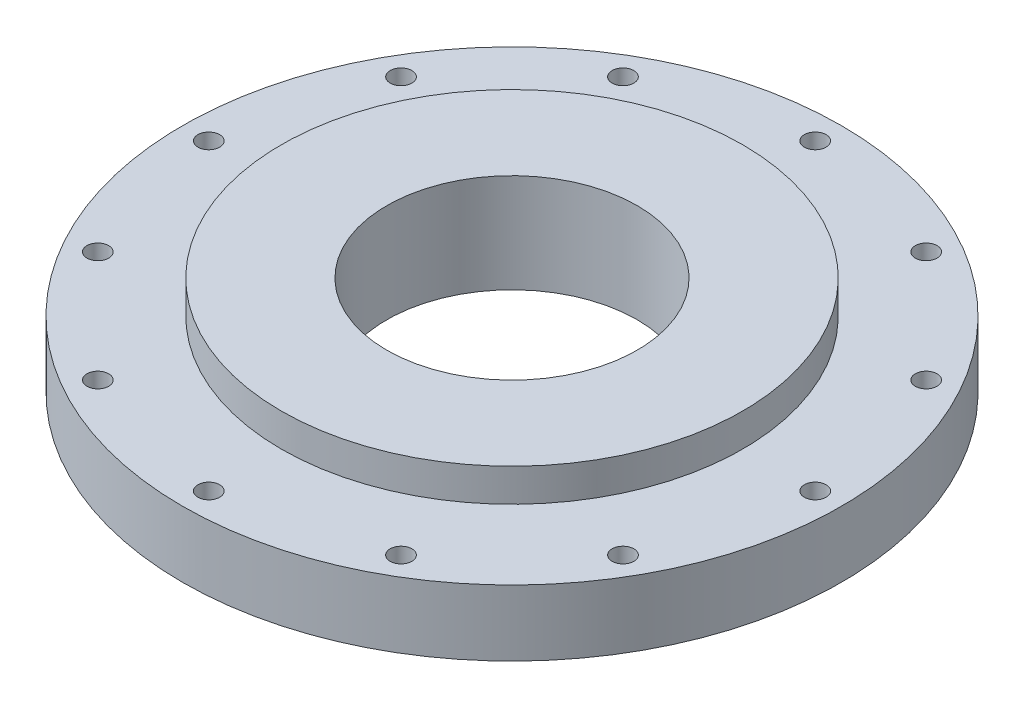
ISO-10303-21;
HEADER;
FILE_DESCRIPTION(('STEP AP214'),'2;1');
FILE_NAME('part.step','',(''),(''),'','','');
FILE_SCHEMA(('AUTOMOTIVE_DESIGN { 1 0 10303 214 1 1 1 1 }'));
ENDSEC;
DATA;
#1=APPLICATION_CONTEXT('core data for automotive mechanical design processes');
#2=APPLICATION_PROTOCOL_DEFINITION('international standard','automotive_design',2000,#1);
#3=PRODUCT_CONTEXT('',#1,'mechanical');
#4=PRODUCT('Part','Part','',(#3));
#5=PRODUCT_RELATED_PRODUCT_CATEGORY('part','',(#4));
#6=PRODUCT_DEFINITION_FORMATION('','',#4);
#7=PRODUCT_DEFINITION_CONTEXT('part definition',#1,'design');
#8=PRODUCT_DEFINITION('design','',#6,#7);
#9=PRODUCT_DEFINITION_SHAPE('','',#8);
#10=(LENGTH_UNIT() NAMED_UNIT(*) SI_UNIT(.MILLI.,.METRE.));
#11=(NAMED_UNIT(*) PLANE_ANGLE_UNIT() SI_UNIT($,.RADIAN.));
#12=(NAMED_UNIT(*) SI_UNIT($,.STERADIAN.) SOLID_ANGLE_UNIT());
#13=UNCERTAINTY_MEASURE_WITH_UNIT(LENGTH_MEASURE(1.E-05),#10,'distance_accuracy_value','');
#14=(GEOMETRIC_REPRESENTATION_CONTEXT(3) GLOBAL_UNCERTAINTY_ASSIGNED_CONTEXT((#13)) GLOBAL_UNIT_ASSIGNED_CONTEXT((#10,
#11,#12)) REPRESENTATION_CONTEXT('',''));
#15=CARTESIAN_POINT('',(0.,0.,0.));
#16=DIRECTION('',(0.,0.,1.));
#17=DIRECTION('',(1.,0.,0.));
#18=AXIS2_PLACEMENT_3D('',#15,#16,#17);
#19=CARTESIAN_POINT('',(0.,12.7,0.));
#20=DIRECTION('',(0.,-1.,0.));
#21=DIRECTION('',(0.,0.,-1.));
#22=AXIS2_PLACEMENT_3D('',#19,#20,#21);
#23=CYLINDRICAL_SURFACE('',#22,63.5);
#24=CARTESIAN_POINT('',(0.,12.7,0.));
#25=DIRECTION('',(0.,1.,0.));
#26=DIRECTION('',(0.,0.,1.));
#27=AXIS2_PLACEMENT_3D('',#24,#25,#26);
#28=CIRCLE('',#27,63.5);
#29=CARTESIAN_POINT('',(0.,12.7,63.5));
#30=VERTEX_POINT('',#29);
#31=EDGE_CURVE('E45',#30,#30,#28,.T.);
#32=ORIENTED_EDGE('',*,*,#31,.F.);
#33=EDGE_LOOP('',(#32));
#34=FACE_BOUND('',#33,.T.);
#35=CARTESIAN_POINT('',(0.,0.,0.));
#36=DIRECTION('',(0.,1.,0.));
#37=DIRECTION('',(0.,0.,1.));
#38=AXIS2_PLACEMENT_3D('',#35,#36,#37);
#39=CIRCLE('',#38,63.5);
#40=CARTESIAN_POINT('',(0.,0.,63.5));
#41=VERTEX_POINT('',#40);
#42=EDGE_CURVE('E51',#41,#41,#39,.T.);
#43=ORIENTED_EDGE('',*,*,#42,.T.);
#44=EDGE_LOOP('',(#43));
#45=FACE_BOUND('',#44,.T.);
#46=ADVANCED_FACE('F37',(#34,#45),#23,.T.);
#47=CARTESIAN_POINT('',(0.,12.7,0.));
#48=DIRECTION('',(0.,1.,0.));
#49=DIRECTION('',(0.,0.,1.));
#50=AXIS2_PLACEMENT_3D('',#47,#48,#49);
#51=PLANE('',#50);
#52=CARTESIAN_POINT('',(0.,12.7,-58.42));
#53=DIRECTION('',(0.,1.,0.));
#54=DIRECTION('',(0.,0.,1.));
#55=AXIS2_PLACEMENT_3D('',#52,#53,#54);
#56=CIRCLE('',#55,2.0955);
#57=CARTESIAN_POINT('',(0.,12.7,-56.3245));
#58=VERTEX_POINT('',#57);
#59=EDGE_CURVE('E71',#58,#58,#56,.T.);
#60=ORIENTED_EDGE('',*,*,#59,.F.);
#61=EDGE_LOOP('',(#60));
#62=FACE_BOUND('',#61,.T.);
#63=CARTESIAN_POINT('',(29.2099999999994,12.7,-50.5932040890873));
#64=DIRECTION('',(0.,1.,0.));
#65=DIRECTION('',(0.,0.,1.));
#66=AXIS2_PLACEMENT_3D('',#63,#64,#65);
#67=CIRCLE('',#66,2.0955);
#68=CARTESIAN_POINT('',(29.2099999999994,12.7,-48.4977040890873));
#69=VERTEX_POINT('',#68);
#70=EDGE_CURVE('E76',#69,#69,#67,.T.);
#71=ORIENTED_EDGE('',*,*,#70,.F.);
#72=EDGE_LOOP('',(#71));
#73=FACE_BOUND('',#72,.T.);
#74=CARTESIAN_POINT('',(50.5932040890866,12.7,-29.2100000000006));
#75=DIRECTION('',(0.,1.,0.));
#76=DIRECTION('',(0.,0.,1.));
#77=AXIS2_PLACEMENT_3D('',#74,#75,#76);
#78=CIRCLE('',#77,2.0955);
#79=CARTESIAN_POINT('',(50.5932040890866,12.7,-27.1145000000006));
#80=VERTEX_POINT('',#79);
#81=EDGE_CURVE('E82',#80,#80,#78,.T.);
#82=ORIENTED_EDGE('',*,*,#81,.F.);
#83=EDGE_LOOP('',(#82));
#84=FACE_BOUND('',#83,.T.);
#85=CARTESIAN_POINT('',(58.42,12.7,-6.11917019445648E-13));
#86=DIRECTION('',(0.,1.,0.));
#87=DIRECTION('',(0.,0.,1.));
#88=AXIS2_PLACEMENT_3D('',#85,#86,#87);
#89=CIRCLE('',#88,2.0955);
#90=CARTESIAN_POINT('',(58.42,12.7,2.09549999999939));
#91=VERTEX_POINT('',#90);
#92=EDGE_CURVE('E86',#91,#91,#89,.T.);
#93=ORIENTED_EDGE('',*,*,#92,.F.);
#94=EDGE_LOOP('',(#93));
#95=FACE_BOUND('',#94,.T.);
#96=CARTESIAN_POINT('',(-29.2100000000001,12.7,-50.5932040890869));
#97=DIRECTION('',(0.,1.,0.));
#98=DIRECTION('',(0.,0.,1.));
#99=AXIS2_PLACEMENT_3D('',#96,#97,#98);
#100=CIRCLE('',#99,2.0955);
#101=CARTESIAN_POINT('',(-29.2100000000001,12.7,-48.4977040890869));
#102=VERTEX_POINT('',#101);
#103=EDGE_CURVE('E90',#102,#102,#100,.T.);
#104=ORIENTED_EDGE('',*,*,#103,.F.);
#105=EDGE_LOOP('',(#104));
#106=FACE_BOUND('',#105,.T.);
#107=CARTESIAN_POINT('',(-50.593204089087,12.7,-29.2099999999999));
#108=DIRECTION('',(0.,1.,0.));
#109=DIRECTION('',(0.,0.,1.));
#110=AXIS2_PLACEMENT_3D('',#107,#108,#109);
#111=CIRCLE('',#110,2.0955);
#112=CARTESIAN_POINT('',(-50.593204089087,12.7,-27.1144999999999));
#113=VERTEX_POINT('',#112);
#114=EDGE_CURVE('E94',#113,#113,#111,.T.);
#115=ORIENTED_EDGE('',*,*,#114,.F.);
#116=EDGE_LOOP('',(#115));
#117=FACE_BOUND('',#116,.T.);
#118=CARTESIAN_POINT('',(-58.42,12.7,2.03972339815216E-13));
#119=DIRECTION('',(0.,1.,0.));
#120=DIRECTION('',(0.,0.,1.));
#121=AXIS2_PLACEMENT_3D('',#118,#119,#120);
#122=CIRCLE('',#121,2.0955);
#123=CARTESIAN_POINT('',(-58.42,12.7,2.09550000000021));
#124=VERTEX_POINT('',#123);
#125=EDGE_CURVE('E98',#124,#124,#122,.T.);
#126=ORIENTED_EDGE('',*,*,#125,.F.);
#127=EDGE_LOOP('',(#126));
#128=FACE_BOUND('',#127,.T.);
#129=CARTESIAN_POINT('',(-50.5932040890868,12.7,29.2100000000002));
#130=DIRECTION('',(0.,1.,0.));
#131=DIRECTION('',(0.,0.,1.));
#132=AXIS2_PLACEMENT_3D('',#129,#130,#131);
#133=CIRCLE('',#132,2.0955);
#134=CARTESIAN_POINT('',(-50.5932040890868,12.7,31.3055000000002));
#135=VERTEX_POINT('',#134);
#136=EDGE_CURVE('E102',#135,#135,#133,.T.);
#137=ORIENTED_EDGE('',*,*,#136,.F.);
#138=EDGE_LOOP('',(#137));
#139=FACE_BOUND('',#138,.T.);
#140=CARTESIAN_POINT('',(-29.2099999999997,12.7,50.5932040890871));
#141=DIRECTION('',(0.,1.,0.));
#142=DIRECTION('',(0.,0.,1.));
#143=AXIS2_PLACEMENT_3D('',#140,#141,#142);
#144=CIRCLE('',#143,2.0955);
#145=CARTESIAN_POINT('',(-29.2099999999997,12.7,52.6887040890871));
#146=VERTEX_POINT('',#145);
#147=EDGE_CURVE('E106',#146,#146,#144,.T.);
#148=ORIENTED_EDGE('',*,*,#147,.F.);
#149=EDGE_LOOP('',(#148));
#150=FACE_BOUND('',#149,.T.);
#151=CARTESIAN_POINT('',(4.07944679630432E-13,12.7,58.42));
#152=DIRECTION('',(0.,1.,0.));
#153=DIRECTION('',(0.,0.,1.));
#154=AXIS2_PLACEMENT_3D('',#151,#152,#153);
#155=CIRCLE('',#154,2.0955);
#156=CARTESIAN_POINT('',(4.07944679630432E-13,12.7,60.5155));
#157=VERTEX_POINT('',#156);
#158=EDGE_CURVE('E110',#157,#157,#155,.T.);
#159=ORIENTED_EDGE('',*,*,#158,.F.);
#160=EDGE_LOOP('',(#159));
#161=FACE_BOUND('',#160,.T.);
#162=CARTESIAN_POINT('',(29.2100000000004,12.7,50.5932040890867));
#163=DIRECTION('',(0.,1.,0.));
#164=DIRECTION('',(0.,0.,1.));
#165=AXIS2_PLACEMENT_3D('',#162,#163,#164);
#166=CIRCLE('',#165,2.0955);
#167=CARTESIAN_POINT('',(29.2100000000004,12.7,52.6887040890867));
#168=VERTEX_POINT('',#167);
#169=EDGE_CURVE('E114',#168,#168,#166,.T.);
#170=ORIENTED_EDGE('',*,*,#169,.F.);
#171=EDGE_LOOP('',(#170));
#172=FACE_BOUND('',#171,.T.);
#173=CARTESIAN_POINT('',(50.5932040890872,12.7,29.2099999999995));
#174=DIRECTION('',(0.,1.,0.));
#175=DIRECTION('',(0.,0.,1.));
#176=AXIS2_PLACEMENT_3D('',#173,#174,#175);
#177=CIRCLE('',#176,2.09550000000001);
#178=CARTESIAN_POINT('',(50.5932040890872,12.7,31.3054999999995));
#179=VERTEX_POINT('',#178);
#180=EDGE_CURVE('E118',#179,#179,#177,.T.);
#181=ORIENTED_EDGE('',*,*,#180,.F.);
#182=EDGE_LOOP('',(#181));
#183=FACE_BOUND('',#182,.T.);
#184=CARTESIAN_POINT('',(0.,12.7,0.));
#185=DIRECTION('',(0.,1.,0.));
#186=DIRECTION('',(0.,0.,1.));
#187=AXIS2_PLACEMENT_3D('',#184,#185,#186);
#188=CIRCLE('',#187,44.45);
#189=CARTESIAN_POINT('',(0.,12.7,44.45));
#190=VERTEX_POINT('',#189);
#191=EDGE_CURVE('E10',#190,#190,#188,.T.);
#192=ORIENTED_EDGE('',*,*,#191,.F.);
#193=EDGE_LOOP('',(#192));
#194=FACE_BOUND('',#193,.T.);
#195=ORIENTED_EDGE('',*,*,#31,.T.);
#196=EDGE_LOOP('',(#195));
#197=FACE_BOUND('',#196,.T.);
#198=ADVANCED_FACE('F177',(#62,#73,#84,#95,#106,#117,#128,#139,#150,#161,#172,#183,#194,#197),
#51,.T.);
#199=CARTESIAN_POINT('',(0.,0.,0.));
#200=DIRECTION('',(0.,1.,0.));
#201=DIRECTION('',(0.,0.,1.));
#202=AXIS2_PLACEMENT_3D('',#199,#200,#201);
#203=PLANE('',#202);
#204=CARTESIAN_POINT('',(0.,0.,-58.42));
#205=DIRECTION('',(0.,-1.,0.));
#206=DIRECTION('',(0.,0.,-1.));
#207=AXIS2_PLACEMENT_3D('',#204,#205,#206);
#208=CIRCLE('',#207,2.0955);
#209=CARTESIAN_POINT('',(0.,0.,-60.5155));
#210=VERTEX_POINT('',#209);
#211=EDGE_CURVE('E122',#210,#210,#208,.T.);
#212=ORIENTED_EDGE('',*,*,#211,.F.);
#213=EDGE_LOOP('',(#212));
#214=FACE_BOUND('',#213,.T.);
#215=CARTESIAN_POINT('',(29.2099999999994,0.,-50.5932040890873));
#216=DIRECTION('',(0.,-1.,0.));
#217=DIRECTION('',(0.,0.,-1.));
#218=AXIS2_PLACEMENT_3D('',#215,#216,#217);
#219=CIRCLE('',#218,2.0955);
#220=CARTESIAN_POINT('',(29.2099999999994,0.,-52.6887040890873));
#221=VERTEX_POINT('',#220);
#222=EDGE_CURVE('E156',#221,#221,#219,.T.);
#223=ORIENTED_EDGE('',*,*,#222,.F.);
#224=EDGE_LOOP('',(#223));
#225=FACE_BOUND('',#224,.T.);
#226=CARTESIAN_POINT('',(50.5932040890866,0.,-29.2100000000006));
#227=DIRECTION('',(0.,-1.,0.));
#228=DIRECTION('',(0.,0.,-1.));
#229=AXIS2_PLACEMENT_3D('',#226,#227,#228);
#230=CIRCLE('',#229,2.0955);
#231=CARTESIAN_POINT('',(50.5932040890866,0.,-31.3055000000006));
#232=VERTEX_POINT('',#231);
#233=EDGE_CURVE('E160',#232,#232,#230,.T.);
#234=ORIENTED_EDGE('',*,*,#233,.F.);
#235=EDGE_LOOP('',(#234));
#236=FACE_BOUND('',#235,.T.);
#237=CARTESIAN_POINT('',(58.42,0.,-6.11917019445648E-13));
#238=DIRECTION('',(0.,-1.,0.));
#239=DIRECTION('',(0.,0.,-1.));
#240=AXIS2_PLACEMENT_3D('',#237,#238,#239);
#241=CIRCLE('',#240,2.0955);
#242=CARTESIAN_POINT('',(58.42,0.,-2.09550000000061));
#243=VERTEX_POINT('',#242);
#244=EDGE_CURVE('E145',#243,#243,#241,.T.);
#245=ORIENTED_EDGE('',*,*,#244,.F.);
#246=EDGE_LOOP('',(#245));
#247=FACE_BOUND('',#246,.T.);
#248=CARTESIAN_POINT('',(-29.2100000000001,0.,-50.5932040890869));
#249=DIRECTION('',(0.,-1.,0.));
#250=DIRECTION('',(0.,0.,-1.));
#251=AXIS2_PLACEMENT_3D('',#248,#249,#250);
#252=CIRCLE('',#251,2.0955);
#253=CARTESIAN_POINT('',(-29.2100000000001,0.,-52.6887040890869));
#254=VERTEX_POINT('',#253);
#255=EDGE_CURVE('E136',#254,#254,#252,.T.);
#256=ORIENTED_EDGE('',*,*,#255,.F.);
#257=EDGE_LOOP('',(#256));
#258=FACE_BOUND('',#257,.T.);
#259=CARTESIAN_POINT('',(-50.593204089087,0.,-29.2099999999999));
#260=DIRECTION('',(0.,-1.,0.));
#261=DIRECTION('',(0.,0.,-1.));
#262=AXIS2_PLACEMENT_3D('',#259,#260,#261);
#263=CIRCLE('',#262,2.0955);
#264=CARTESIAN_POINT('',(-50.593204089087,0.,-31.3054999999999));
#265=VERTEX_POINT('',#264);
#266=EDGE_CURVE('E132',#265,#265,#263,.T.);
#267=ORIENTED_EDGE('',*,*,#266,.F.);
#268=EDGE_LOOP('',(#267));
#269=FACE_BOUND('',#268,.T.);
#270=CARTESIAN_POINT('',(-58.42,0.,2.03972339815216E-13));
#271=DIRECTION('',(0.,-1.,0.));
#272=DIRECTION('',(0.,0.,-1.));
#273=AXIS2_PLACEMENT_3D('',#270,#271,#272);
#274=CIRCLE('',#273,2.0955);
#275=CARTESIAN_POINT('',(-58.42,0.,-2.0954999999998));
#276=VERTEX_POINT('',#275);
#277=EDGE_CURVE('E127',#276,#276,#274,.T.);
#278=ORIENTED_EDGE('',*,*,#277,.F.);
#279=EDGE_LOOP('',(#278));
#280=FACE_BOUND('',#279,.T.);
#281=CARTESIAN_POINT('',(-50.5932040890868,0.,29.2100000000002));
#282=DIRECTION('',(0.,-1.,0.));
#283=DIRECTION('',(0.,0.,-1.));
#284=AXIS2_PLACEMENT_3D('',#281,#282,#283);
#285=CIRCLE('',#284,2.0955);
#286=CARTESIAN_POINT('',(-50.5932040890868,0.,27.1145000000002));
#287=VERTEX_POINT('',#286);
#288=EDGE_CURVE('E123',#287,#287,#285,.T.);
#289=ORIENTED_EDGE('',*,*,#288,.F.);
#290=EDGE_LOOP('',(#289));
#291=FACE_BOUND('',#290,.T.);
#292=CARTESIAN_POINT('',(-29.2099999999997,0.,50.5932040890871));
#293=DIRECTION('',(0.,-1.,0.));
#294=DIRECTION('',(0.,0.,-1.));
#295=AXIS2_PLACEMENT_3D('',#292,#293,#294);
#296=CIRCLE('',#295,2.0955);
#297=CARTESIAN_POINT('',(-29.2099999999997,0.,48.4977040890871));
#298=VERTEX_POINT('',#297);
#299=EDGE_CURVE('E128',#298,#298,#296,.T.);
#300=ORIENTED_EDGE('',*,*,#299,.F.);
#301=EDGE_LOOP('',(#300));
#302=FACE_BOUND('',#301,.T.);
#303=CARTESIAN_POINT('',(4.07944679630432E-13,0.,58.42));
#304=DIRECTION('',(0.,-1.,0.));
#305=DIRECTION('',(0.,0.,-1.));
#306=AXIS2_PLACEMENT_3D('',#303,#304,#305);
#307=CIRCLE('',#306,2.0955);
#308=CARTESIAN_POINT('',(4.07944679630432E-13,0.,56.3245));
#309=VERTEX_POINT('',#308);
#310=EDGE_CURVE('E149',#309,#309,#307,.T.);
#311=ORIENTED_EDGE('',*,*,#310,.F.);
#312=EDGE_LOOP('',(#311));
#313=FACE_BOUND('',#312,.T.);
#314=CARTESIAN_POINT('',(29.2100000000004,0.,50.5932040890867));
#315=DIRECTION('',(0.,-1.,0.));
#316=DIRECTION('',(0.,0.,-1.));
#317=AXIS2_PLACEMENT_3D('',#314,#315,#316);
#318=CIRCLE('',#317,2.0955);
#319=CARTESIAN_POINT('',(29.2100000000004,0.,48.4977040890867));
#320=VERTEX_POINT('',#319);
#321=EDGE_CURVE('E144',#320,#320,#318,.T.);
#322=ORIENTED_EDGE('',*,*,#321,.F.);
#323=EDGE_LOOP('',(#322));
#324=FACE_BOUND('',#323,.T.);
#325=CARTESIAN_POINT('',(50.5932040890872,0.,29.2099999999995));
#326=DIRECTION('',(0.,-1.,0.));
#327=DIRECTION('',(0.,0.,-1.));
#328=AXIS2_PLACEMENT_3D('',#325,#326,#327);
#329=CIRCLE('',#328,2.09550000000001);
#330=CARTESIAN_POINT('',(50.5932040890872,0.,27.1144999999995));
#331=VERTEX_POINT('',#330);
#332=EDGE_CURVE('E140',#331,#331,#329,.T.);
#333=ORIENTED_EDGE('',*,*,#332,.F.);
#334=EDGE_LOOP('',(#333));
#335=FACE_BOUND('',#334,.T.);
#336=CARTESIAN_POINT('',(0.,0.,0.));
#337=DIRECTION('',(0.,1.,0.));
#338=DIRECTION('',(0.,0.,1.));
#339=AXIS2_PLACEMENT_3D('',#336,#337,#338);
#340=CIRCLE('',#339,24.13);
#341=CARTESIAN_POINT('',(0.,0.,24.13));
#342=VERTEX_POINT('',#341);
#343=EDGE_CURVE('E66',#342,#342,#340,.T.);
#344=ORIENTED_EDGE('',*,*,#343,.T.);
#345=EDGE_LOOP('',(#344));
#346=FACE_BOUND('',#345,.T.);
#347=ORIENTED_EDGE('',*,*,#42,.F.);
#348=EDGE_LOOP('',(#347));
#349=FACE_BOUND('',#348,.T.);
#350=ADVANCED_FACE('F173',(#214,#225,#236,#247,#258,#269,#280,#291,#302,#313,#324,#335,#346,
#349),#203,.F.);
#351=CARTESIAN_POINT('',(0.,19.05,0.));
#352=DIRECTION('',(0.,-1.,0.));
#353=DIRECTION('',(0.,0.,-1.));
#354=AXIS2_PLACEMENT_3D('',#351,#352,#353);
#355=CYLINDRICAL_SURFACE('',#354,44.45);
#356=CARTESIAN_POINT('',(0.,19.05,0.));
#357=DIRECTION('',(0.,1.,0.));
#358=DIRECTION('',(0.,0.,1.));
#359=AXIS2_PLACEMENT_3D('',#356,#357,#358);
#360=CIRCLE('',#359,44.45);
#361=CARTESIAN_POINT('',(0.,19.05,44.45));
#362=VERTEX_POINT('',#361);
#363=EDGE_CURVE('E54',#362,#362,#360,.T.);
#364=ORIENTED_EDGE('',*,*,#363,.F.);
#365=EDGE_LOOP('',(#364));
#366=FACE_BOUND('',#365,.T.);
#367=ORIENTED_EDGE('',*,*,#191,.T.);
#368=EDGE_LOOP('',(#367));
#369=FACE_BOUND('',#368,.T.);
#370=ADVANCED_FACE('F176',(#366,#369),#355,.T.);
#371=CARTESIAN_POINT('',(0.,19.05,0.));
#372=DIRECTION('',(0.,1.,0.));
#373=DIRECTION('',(0.,0.,1.));
#374=AXIS2_PLACEMENT_3D('',#371,#372,#373);
#375=PLANE('',#374);
#376=CARTESIAN_POINT('',(0.,19.05,0.));
#377=DIRECTION('',(0.,1.,0.));
#378=DIRECTION('',(0.,0.,1.));
#379=AXIS2_PLACEMENT_3D('',#376,#377,#378);
#380=CIRCLE('',#379,24.13);
#381=CARTESIAN_POINT('',(0.,19.05,24.13));
#382=VERTEX_POINT('',#381);
#383=EDGE_CURVE('E40',#382,#382,#380,.T.);
#384=ORIENTED_EDGE('',*,*,#383,.F.);
#385=EDGE_LOOP('',(#384));
#386=FACE_BOUND('',#385,.T.);
#387=ORIENTED_EDGE('',*,*,#363,.T.);
#388=EDGE_LOOP('',(#387));
#389=FACE_BOUND('',#388,.T.);
#390=ADVANCED_FACE('F214',(#386,#389),#375,.T.);
#391=CARTESIAN_POINT('',(0.,0.,0.));
#392=DIRECTION('',(0.,1.,0.));
#393=DIRECTION('',(0.,0.,1.));
#394=AXIS2_PLACEMENT_3D('',#391,#392,#393);
#395=CYLINDRICAL_SURFACE('',#394,24.13);
#396=ORIENTED_EDGE('',*,*,#383,.T.);
#397=EDGE_LOOP('',(#396));
#398=FACE_BOUND('',#397,.T.);
#399=ORIENTED_EDGE('',*,*,#343,.F.);
#400=EDGE_LOOP('',(#399));
#401=FACE_BOUND('',#400,.T.);
#402=ADVANCED_FACE('F204',(#398,#401),#395,.F.);
#403=CARTESIAN_POINT('',(50.5932040890872,19.05,29.2099999999995));
#404=DIRECTION('',(0.,-1.,0.));
#405=DIRECTION('',(0.,0.,-1.));
#406=AXIS2_PLACEMENT_3D('',#403,#404,#405);
#407=CYLINDRICAL_SURFACE('',#406,2.09550000000001);
#408=ORIENTED_EDGE('',*,*,#180,.T.);
#409=EDGE_LOOP('',(#408));
#410=FACE_BOUND('',#409,.T.);
#411=ORIENTED_EDGE('',*,*,#332,.T.);
#412=EDGE_LOOP('',(#411));
#413=FACE_BOUND('',#412,.T.);
#414=ADVANCED_FACE('F201',(#410,#413),#407,.F.);
#415=CARTESIAN_POINT('',(29.2100000000004,19.05,50.5932040890867));
#416=DIRECTION('',(0.,-1.,0.));
#417=DIRECTION('',(0.,0.,-1.));
#418=AXIS2_PLACEMENT_3D('',#415,#416,#417);
#419=CYLINDRICAL_SURFACE('',#418,2.0955);
#420=ORIENTED_EDGE('',*,*,#169,.T.);
#421=EDGE_LOOP('',(#420));
#422=FACE_BOUND('',#421,.T.);
#423=ORIENTED_EDGE('',*,*,#321,.T.);
#424=EDGE_LOOP('',(#423));
#425=FACE_BOUND('',#424,.T.);
#426=ADVANCED_FACE('F203',(#422,#425),#419,.F.);
#427=CARTESIAN_POINT('',(4.07944679630432E-13,19.05,58.42));
#428=DIRECTION('',(0.,-1.,0.));
#429=DIRECTION('',(0.,0.,-1.));
#430=AXIS2_PLACEMENT_3D('',#427,#428,#429);
#431=CYLINDRICAL_SURFACE('',#430,2.0955);
#432=ORIENTED_EDGE('',*,*,#158,.T.);
#433=EDGE_LOOP('',(#432));
#434=FACE_BOUND('',#433,.T.);
#435=ORIENTED_EDGE('',*,*,#310,.T.);
#436=EDGE_LOOP('',(#435));
#437=FACE_BOUND('',#436,.T.);
#438=ADVANCED_FACE('F211',(#434,#437),#431,.F.);
#439=CARTESIAN_POINT('',(-29.2099999999997,19.05,50.5932040890871));
#440=DIRECTION('',(0.,-1.,0.));
#441=DIRECTION('',(0.,0.,-1.));
#442=AXIS2_PLACEMENT_3D('',#439,#440,#441);
#443=CYLINDRICAL_SURFACE('',#442,2.0955);
#444=ORIENTED_EDGE('',*,*,#147,.T.);
#445=EDGE_LOOP('',(#444));
#446=FACE_BOUND('',#445,.T.);
#447=ORIENTED_EDGE('',*,*,#299,.T.);
#448=EDGE_LOOP('',(#447));
#449=FACE_BOUND('',#448,.T.);
#450=ADVANCED_FACE('F241',(#446,#449),#443,.F.);
#451=CARTESIAN_POINT('',(-50.5932040890868,19.05,29.2100000000002));
#452=DIRECTION('',(0.,-1.,0.));
#453=DIRECTION('',(0.,0.,-1.));
#454=AXIS2_PLACEMENT_3D('',#451,#452,#453);
#455=CYLINDRICAL_SURFACE('',#454,2.0955);
#456=ORIENTED_EDGE('',*,*,#136,.T.);
#457=EDGE_LOOP('',(#456));
#458=FACE_BOUND('',#457,.T.);
#459=ORIENTED_EDGE('',*,*,#288,.T.);
#460=EDGE_LOOP('',(#459));
#461=FACE_BOUND('',#460,.T.);
#462=ADVANCED_FACE('F237',(#458,#461),#455,.F.);
#463=CARTESIAN_POINT('',(-58.42,19.05,2.03972339815216E-13));
#464=DIRECTION('',(0.,-1.,0.));
#465=DIRECTION('',(0.,0.,-1.));
#466=AXIS2_PLACEMENT_3D('',#463,#464,#465);
#467=CYLINDRICAL_SURFACE('',#466,2.0955);
#468=ORIENTED_EDGE('',*,*,#125,.T.);
#469=EDGE_LOOP('',(#468));
#470=FACE_BOUND('',#469,.T.);
#471=ORIENTED_EDGE('',*,*,#277,.T.);
#472=EDGE_LOOP('',(#471));
#473=FACE_BOUND('',#472,.T.);
#474=ADVANCED_FACE('F240',(#470,#473),#467,.F.);
#475=CARTESIAN_POINT('',(-50.593204089087,19.05,-29.2099999999999));
#476=DIRECTION('',(0.,-1.,0.));
#477=DIRECTION('',(0.,0.,-1.));
#478=AXIS2_PLACEMENT_3D('',#475,#476,#477);
#479=CYLINDRICAL_SURFACE('',#478,2.0955);
#480=ORIENTED_EDGE('',*,*,#114,.T.);
#481=EDGE_LOOP('',(#480));
#482=FACE_BOUND('',#481,.T.);
#483=ORIENTED_EDGE('',*,*,#266,.T.);
#484=EDGE_LOOP('',(#483));
#485=FACE_BOUND('',#484,.T.);
#486=ADVANCED_FACE('F245',(#482,#485),#479,.F.);
#487=CARTESIAN_POINT('',(-29.2100000000001,19.05,-50.5932040890869));
#488=DIRECTION('',(0.,-1.,0.));
#489=DIRECTION('',(0.,0.,-1.));
#490=AXIS2_PLACEMENT_3D('',#487,#488,#489);
#491=CYLINDRICAL_SURFACE('',#490,2.0955);
#492=ORIENTED_EDGE('',*,*,#103,.T.);
#493=EDGE_LOOP('',(#492));
#494=FACE_BOUND('',#493,.T.);
#495=ORIENTED_EDGE('',*,*,#255,.T.);
#496=EDGE_LOOP('',(#495));
#497=FACE_BOUND('',#496,.T.);
#498=ADVANCED_FACE('F248',(#494,#497),#491,.F.);
#499=CARTESIAN_POINT('',(58.42,19.05,-6.11917019445648E-13));
#500=DIRECTION('',(0.,-1.,0.));
#501=DIRECTION('',(0.,0.,-1.));
#502=AXIS2_PLACEMENT_3D('',#499,#500,#501);
#503=CYLINDRICAL_SURFACE('',#502,2.0955);
#504=ORIENTED_EDGE('',*,*,#92,.T.);
#505=EDGE_LOOP('',(#504));
#506=FACE_BOUND('',#505,.T.);
#507=ORIENTED_EDGE('',*,*,#244,.T.);
#508=EDGE_LOOP('',(#507));
#509=FACE_BOUND('',#508,.T.);
#510=ADVANCED_FACE('F251',(#506,#509),#503,.F.);
#511=CARTESIAN_POINT('',(50.5932040890866,19.05,-29.2100000000006));
#512=DIRECTION('',(0.,-1.,0.));
#513=DIRECTION('',(0.,0.,-1.));
#514=AXIS2_PLACEMENT_3D('',#511,#512,#513);
#515=CYLINDRICAL_SURFACE('',#514,2.0955);
#516=ORIENTED_EDGE('',*,*,#81,.T.);
#517=EDGE_LOOP('',(#516));
#518=FACE_BOUND('',#517,.T.);
#519=ORIENTED_EDGE('',*,*,#233,.T.);
#520=EDGE_LOOP('',(#519));
#521=FACE_BOUND('',#520,.T.);
#522=ADVANCED_FACE('F256',(#518,#521),#515,.F.);
#523=CARTESIAN_POINT('',(29.2099999999994,19.05,-50.5932040890873));
#524=DIRECTION('',(0.,-1.,0.));
#525=DIRECTION('',(0.,0.,-1.));
#526=AXIS2_PLACEMENT_3D('',#523,#524,#525);
#527=CYLINDRICAL_SURFACE('',#526,2.0955);
#528=ORIENTED_EDGE('',*,*,#70,.T.);
#529=EDGE_LOOP('',(#528));
#530=FACE_BOUND('',#529,.T.);
#531=ORIENTED_EDGE('',*,*,#222,.T.);
#532=EDGE_LOOP('',(#531));
#533=FACE_BOUND('',#532,.T.);
#534=ADVANCED_FACE('F288',(#530,#533),#527,.F.);
#535=CARTESIAN_POINT('',(0.,19.05,-58.42));
#536=DIRECTION('',(0.,-1.,0.));
#537=DIRECTION('',(0.,0.,-1.));
#538=AXIS2_PLACEMENT_3D('',#535,#536,#537);
#539=CYLINDRICAL_SURFACE('',#538,2.0955);
#540=ORIENTED_EDGE('',*,*,#59,.T.);
#541=EDGE_LOOP('',(#540));
#542=FACE_BOUND('',#541,.T.);
#543=ORIENTED_EDGE('',*,*,#211,.T.);
#544=EDGE_LOOP('',(#543));
#545=FACE_BOUND('',#544,.T.);
#546=ADVANCED_FACE('F171',(#542,#545),#539,.F.);
#547=CLOSED_SHELL('',(#46,#198,#350,#370,#390,#402,#414,#426,#438,#450,#462,#474,#486,#498,#510,
#522,#534,#546));
#548=MANIFOLD_SOLID_BREP('B2',#547);
#549=ADVANCED_BREP_SHAPE_REPRESENTATION('',(#18,#548),#14);
#550=SHAPE_DEFINITION_REPRESENTATION(#9,#549);
ENDSEC;
END-ISO-10303-21;
